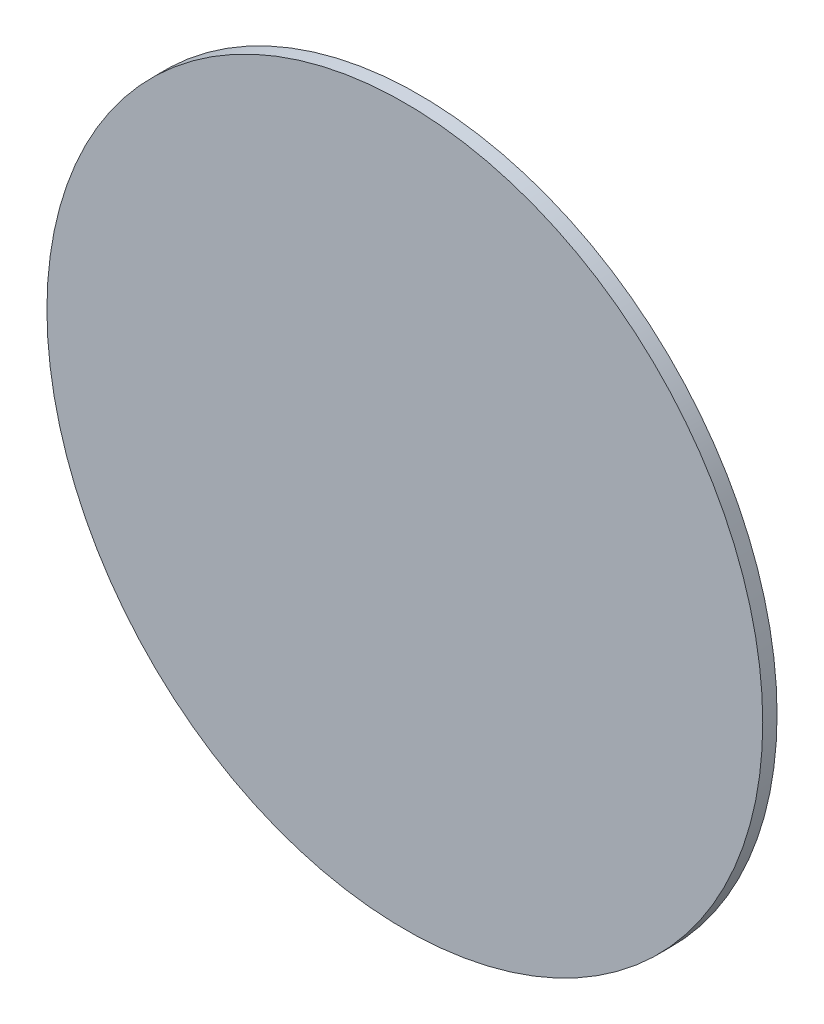
ISO-10303-21;
HEADER;
FILE_DESCRIPTION(('STEP AP214'),'2;1');
FILE_NAME('part.step','',(''),(''),'','','');
FILE_SCHEMA(('AUTOMOTIVE_DESIGN { 1 0 10303 214 1 1 1 1 }'));
ENDSEC;
DATA;
#1=APPLICATION_CONTEXT('core data for automotive mechanical design processes');
#2=APPLICATION_PROTOCOL_DEFINITION('international standard','automotive_design',2000,#1);
#3=PRODUCT_CONTEXT('',#1,'mechanical');
#4=PRODUCT('Part','Part','',(#3));
#5=PRODUCT_RELATED_PRODUCT_CATEGORY('part','',(#4));
#6=PRODUCT_DEFINITION_FORMATION('','',#4);
#7=PRODUCT_DEFINITION_CONTEXT('part definition',#1,'design');
#8=PRODUCT_DEFINITION('design','',#6,#7);
#9=PRODUCT_DEFINITION_SHAPE('','',#8);
#10=(LENGTH_UNIT() NAMED_UNIT(*) SI_UNIT(.MILLI.,.METRE.));
#11=(NAMED_UNIT(*) PLANE_ANGLE_UNIT() SI_UNIT($,.RADIAN.));
#12=(NAMED_UNIT(*) SI_UNIT($,.STERADIAN.) SOLID_ANGLE_UNIT());
#13=UNCERTAINTY_MEASURE_WITH_UNIT(LENGTH_MEASURE(1.E-05),#10,'distance_accuracy_value','');
#14=(GEOMETRIC_REPRESENTATION_CONTEXT(3) GLOBAL_UNCERTAINTY_ASSIGNED_CONTEXT((#13)) GLOBAL_UNIT_ASSIGNED_CONTEXT((#10,
#11,#12)) REPRESENTATION_CONTEXT('',''));
#15=CARTESIAN_POINT('',(0.,0.,0.));
#16=DIRECTION('',(0.,0.,1.));
#17=DIRECTION('',(1.,0.,0.));
#18=AXIS2_PLACEMENT_3D('',#15,#16,#17);
#19=CARTESIAN_POINT('',(0.2499995,0.,0.00999998));
#20=DIRECTION('',(0.,0.,-1.));
#21=DIRECTION('',(0.,-1.,0.));
#22=AXIS2_PLACEMENT_3D('',#19,#20,#21);
#23=PLANE('',#22);
#24=CARTESIAN_POINT('',(0.,0.,0.00999998));
#25=DIRECTION('',(0.,0.,1.));
#26=DIRECTION('',(1.,0.,0.));
#27=AXIS2_PLACEMENT_3D('',#24,#25,#26);
#28=CIRCLE('',#27,0.2499995);
#29=CARTESIAN_POINT('',(0.2499995,0.,0.00999998));
#30=VERTEX_POINT('',#29);
#31=EDGE_CURVE('E11',#30,#30,#28,.T.);
#32=ORIENTED_EDGE('',*,*,#31,.T.);
#33=EDGE_LOOP('',(#32));
#34=FACE_BOUND('',#33,.T.);
#35=ADVANCED_FACE('F17',(#34),#23,.F.);
#36=CARTESIAN_POINT('',(0.2499995,0.,0.));
#37=DIRECTION('',(0.,0.,-1.));
#38=DIRECTION('',(0.,-1.,0.));
#39=AXIS2_PLACEMENT_3D('',#36,#37,#38);
#40=PLANE('',#39);
#41=CARTESIAN_POINT('',(0.,0.,0.));
#42=DIRECTION('',(0.,0.,1.));
#43=DIRECTION('',(1.,0.,0.));
#44=AXIS2_PLACEMENT_3D('',#41,#42,#43);
#45=CIRCLE('',#44,0.2499995);
#46=CARTESIAN_POINT('',(0.2499995,0.,0.));
#47=VERTEX_POINT('',#46);
#48=EDGE_CURVE('E42',#47,#47,#45,.T.);
#49=ORIENTED_EDGE('',*,*,#48,.F.);
#50=EDGE_LOOP('',(#49));
#51=FACE_BOUND('',#50,.T.);
#52=ADVANCED_FACE('F64',(#51),#40,.T.);
#53=CARTESIAN_POINT('',(0.,0.,0.));
#54=DIRECTION('',(0.,0.,-1.));
#55=DIRECTION('',(1.,0.,0.));
#56=AXIS2_PLACEMENT_3D('',#53,#54,#55);
#57=CYLINDRICAL_SURFACE('',#56,0.2499995);
#58=ORIENTED_EDGE('',*,*,#48,.T.);
#59=DIRECTION('',(0.,0.,1.));
#60=VECTOR('',#59,1.);
#61=CARTESIAN_POINT('',(0.2499995,0.,0.));
#62=LINE('',#61,#60);
#63=EDGE_CURVE('E20',#47,#30,#62,.T.);
#64=ORIENTED_EDGE('',*,*,#63,.T.);
#65=ORIENTED_EDGE('',*,*,#31,.F.);
#66=ORIENTED_EDGE('',*,*,#63,.F.);
#67=EDGE_LOOP('',(#58,#64,#65,#66));
#68=FACE_BOUND('',#67,.T.);
#69=ADVANCED_FACE('F40',(#68),#57,.T.);
#70=CLOSED_SHELL('',(#35,#52,#69));
#71=MANIFOLD_SOLID_BREP('B1',#70);
#72=ADVANCED_BREP_SHAPE_REPRESENTATION('',(#18,#71),#14);
#73=SHAPE_DEFINITION_REPRESENTATION(#9,#72);
ENDSEC;
END-ISO-10303-21;
